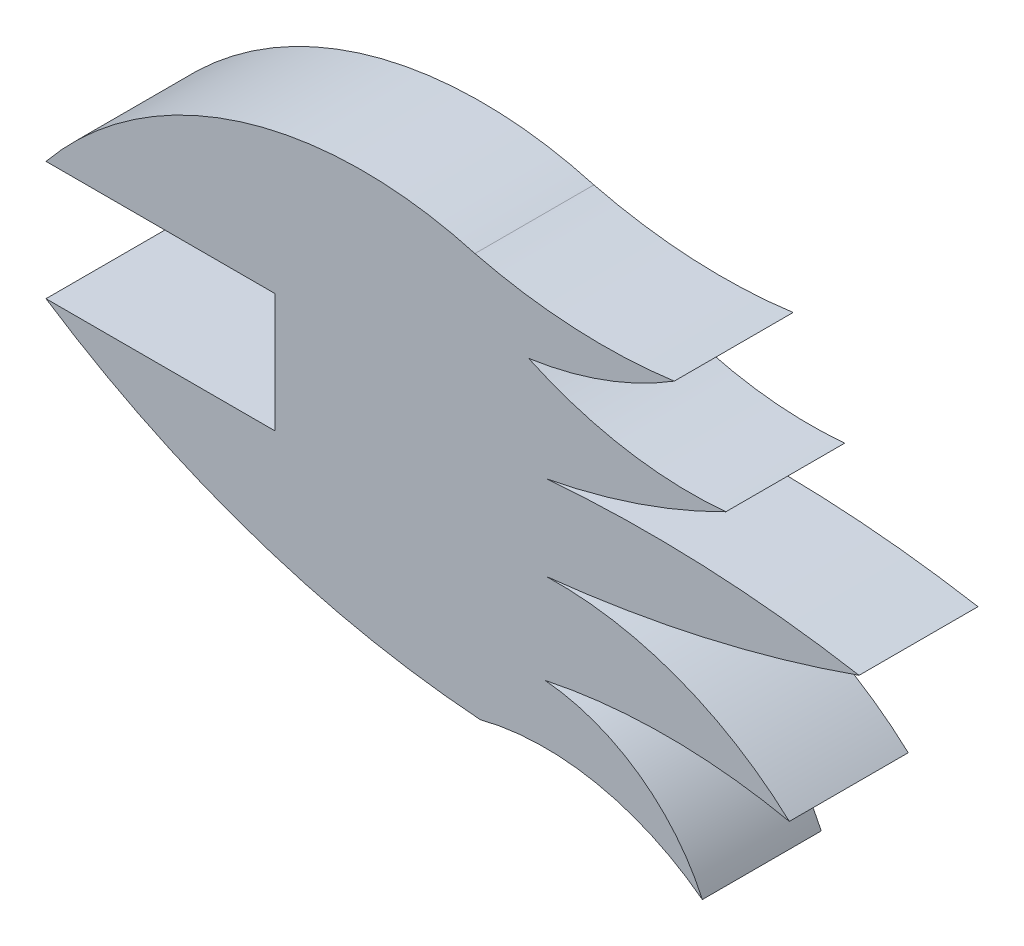
ISO-10303-21;
HEADER;
FILE_DESCRIPTION(('STEP AP214'),'2;1');
FILE_NAME('part.step','',(''),(''),'','','');
FILE_SCHEMA(('AUTOMOTIVE_DESIGN { 1 0 10303 214 1 1 1 1 }'));
ENDSEC;
DATA;
#1=APPLICATION_CONTEXT('core data for automotive mechanical design processes');
#2=APPLICATION_PROTOCOL_DEFINITION('international standard','automotive_design',2000,#1);
#3=PRODUCT_CONTEXT('',#1,'mechanical');
#4=PRODUCT('Part','Part','',(#3));
#5=PRODUCT_RELATED_PRODUCT_CATEGORY('part','',(#4));
#6=PRODUCT_DEFINITION_FORMATION('','',#4);
#7=PRODUCT_DEFINITION_CONTEXT('part definition',#1,'design');
#8=PRODUCT_DEFINITION('design','',#6,#7);
#9=PRODUCT_DEFINITION_SHAPE('','',#8);
#10=(LENGTH_UNIT() NAMED_UNIT(*) SI_UNIT(.MILLI.,.METRE.));
#11=(NAMED_UNIT(*) PLANE_ANGLE_UNIT() SI_UNIT($,.RADIAN.));
#12=(NAMED_UNIT(*) SI_UNIT($,.STERADIAN.) SOLID_ANGLE_UNIT());
#13=UNCERTAINTY_MEASURE_WITH_UNIT(LENGTH_MEASURE(1.E-05),#10,'distance_accuracy_value','');
#14=(GEOMETRIC_REPRESENTATION_CONTEXT(3) GLOBAL_UNCERTAINTY_ASSIGNED_CONTEXT((#13)) GLOBAL_UNIT_ASSIGNED_CONTEXT((#10,
#11,#12)) REPRESENTATION_CONTEXT('',''));
#15=CARTESIAN_POINT('',(0.,0.,0.));
#16=DIRECTION('',(0.,0.,1.));
#17=DIRECTION('',(1.,0.,0.));
#18=AXIS2_PLACEMENT_3D('',#15,#16,#17);
#19=CARTESIAN_POINT('',(20.7675608473323,1.524,1.524));
#20=DIRECTION('',(0.,1.,0.));
#21=DIRECTION('',(0.,0.,1.));
#22=AXIS2_PLACEMENT_3D('',#19,#20,#21);
#23=PLANE('',#22);
#24=DIRECTION('',(1.,0.,0.));
#25=VECTOR('',#24,1.);
#26=CARTESIAN_POINT('',(20.7675608473323,1.524,0.));
#27=LINE('',#26,#25);
#28=CARTESIAN_POINT('',(20.7675608473323,1.524,0.));
#29=VERTEX_POINT('',#28);
#30=CARTESIAN_POINT('',(23.6997454879584,1.524,0.));
#31=VERTEX_POINT('',#30);
#32=EDGE_CURVE('E171',#29,#31,#27,.T.);
#33=ORIENTED_EDGE('',*,*,#32,.T.);
#34=DIRECTION('',(0.,0.,-1.));
#35=VECTOR('',#34,1.);
#36=CARTESIAN_POINT('',(23.6997454879584,1.524,1.524));
#37=LINE('',#36,#35);
#38=CARTESIAN_POINT('',(23.6997454879584,1.524,1.524));
#39=VERTEX_POINT('',#38);
#40=EDGE_CURVE('E11',#39,#31,#37,.T.);
#41=ORIENTED_EDGE('',*,*,#40,.F.);
#42=DIRECTION('',(1.,0.,0.));
#43=VECTOR('',#42,1.);
#44=CARTESIAN_POINT('',(20.7675608473323,1.524,1.524));
#45=LINE('',#44,#43);
#46=CARTESIAN_POINT('',(20.7675608473323,1.524,1.524));
#47=VERTEX_POINT('',#46);
#48=EDGE_CURVE('E199',#47,#39,#45,.T.);
#49=ORIENTED_EDGE('',*,*,#48,.F.);
#50=DIRECTION('',(0.,0.,-1.));
#51=VECTOR('',#50,1.);
#52=CARTESIAN_POINT('',(20.7675608473323,1.524,1.524));
#53=LINE('',#52,#51);
#54=EDGE_CURVE('E167',#47,#29,#53,.T.);
#55=ORIENTED_EDGE('',*,*,#54,.T.);
#56=EDGE_LOOP('',(#33,#41,#49,#55));
#57=FACE_BOUND('',#56,.T.);
#58=ADVANCED_FACE('F33',(#57),#23,.F.);
#59=CARTESIAN_POINT('',(23.6997454879584,1.524,1.524));
#60=DIRECTION('',(1.,0.,0.));
#61=DIRECTION('',(0.,0.,-1.));
#62=AXIS2_PLACEMENT_3D('',#59,#60,#61);
#63=PLANE('',#62);
#64=DIRECTION('',(0.,-1.,0.));
#65=VECTOR('',#64,1.);
#66=CARTESIAN_POINT('',(23.6997454879584,1.524,0.));
#67=LINE('',#66,#65);
#68=CARTESIAN_POINT('',(23.6997454879584,0.,0.));
#69=VERTEX_POINT('',#68);
#70=EDGE_CURVE('E174',#31,#69,#67,.T.);
#71=ORIENTED_EDGE('',*,*,#70,.T.);
#72=DIRECTION('',(0.,0.,-1.));
#73=VECTOR('',#72,1.);
#74=CARTESIAN_POINT('',(23.6997454879584,0.,1.524));
#75=LINE('',#74,#73);
#76=CARTESIAN_POINT('',(23.6997454879584,0.,1.524));
#77=VERTEX_POINT('',#76);
#78=EDGE_CURVE('E41',#77,#69,#75,.T.);
#79=ORIENTED_EDGE('',*,*,#78,.F.);
#80=DIRECTION('',(0.,-1.,0.));
#81=VECTOR('',#80,1.);
#82=CARTESIAN_POINT('',(23.6997454879584,1.524,1.524));
#83=LINE('',#82,#81);
#84=EDGE_CURVE('E113',#39,#77,#83,.T.);
#85=ORIENTED_EDGE('',*,*,#84,.F.);
#86=ORIENTED_EDGE('',*,*,#40,.T.);
#87=EDGE_LOOP('',(#71,#79,#85,#86));
#88=FACE_BOUND('',#87,.T.);
#89=ADVANCED_FACE('F292',(#88),#63,.F.);
#90=CARTESIAN_POINT('',(23.6997454879584,0.,1.524));
#91=DIRECTION('',(0.,-1.,0.));
#92=DIRECTION('',(1.,0.,0.));
#93=AXIS2_PLACEMENT_3D('',#90,#91,#92);
#94=PLANE('',#93);
#95=DIRECTION('',(-1.,0.,0.));
#96=VECTOR('',#95,1.);
#97=CARTESIAN_POINT('',(23.6997454879584,0.,0.));
#98=LINE('',#97,#96);
#99=CARTESIAN_POINT('',(20.7675608473323,0.,0.));
#100=VERTEX_POINT('',#99);
#101=EDGE_CURVE('E176',#69,#100,#98,.T.);
#102=ORIENTED_EDGE('',*,*,#101,.T.);
#103=DIRECTION('',(0.,0.,-1.));
#104=VECTOR('',#103,1.);
#105=CARTESIAN_POINT('',(20.7675608473323,0.,1.524));
#106=LINE('',#105,#104);
#107=CARTESIAN_POINT('',(20.7675608473323,0.,1.524));
#108=VERTEX_POINT('',#107);
#109=EDGE_CURVE('E227',#108,#100,#106,.T.);
#110=ORIENTED_EDGE('',*,*,#109,.F.);
#111=DIRECTION('',(-1.,0.,0.));
#112=VECTOR('',#111,1.);
#113=CARTESIAN_POINT('',(23.6997454879584,0.,1.524));
#114=LINE('',#113,#112);
#115=EDGE_CURVE('E235',#77,#108,#114,.T.);
#116=ORIENTED_EDGE('',*,*,#115,.F.);
#117=ORIENTED_EDGE('',*,*,#78,.T.);
#118=EDGE_LOOP('',(#102,#110,#116,#117));
#119=FACE_BOUND('',#118,.T.);
#120=ADVANCED_FACE('F233',(#119),#94,.F.);
#121=CARTESIAN_POINT('',(27.1776081469586,9.73600604381331,1.524));
#122=DIRECTION('',(0.,0.,-1.));
#123=DIRECTION('',(-1.,0.,0.));
#124=AXIS2_PLACEMENT_3D('',#121,#122,#123);
#125=CYLINDRICAL_SURFACE('',#124,11.6566942169989);
#126=CARTESIAN_POINT('',(27.1776081469586,9.73600604381331,0.));
#127=DIRECTION('',(0.,0.,1.));
#128=DIRECTION('',(1.,0.,0.));
#129=AXIS2_PLACEMENT_3D('',#126,#127,#128);
#130=CIRCLE('',#129,11.6566942169989);
#131=CARTESIAN_POINT('',(26.3328732341961,-1.89003984444014,0.));
#132=VERTEX_POINT('',#131);
#133=EDGE_CURVE('E178',#100,#132,#130,.T.);
#134=ORIENTED_EDGE('',*,*,#133,.T.);
#135=DIRECTION('',(0.,0.,-1.));
#136=VECTOR('',#135,1.);
#137=CARTESIAN_POINT('',(26.3328732341961,-1.89003984444014,1.524));
#138=LINE('',#137,#136);
#139=CARTESIAN_POINT('',(26.3328732341961,-1.89003984444014,1.524));
#140=VERTEX_POINT('',#139);
#141=EDGE_CURVE('E224',#140,#132,#138,.T.);
#142=ORIENTED_EDGE('',*,*,#141,.F.);
#143=CARTESIAN_POINT('',(27.1776081469586,9.73600604381331,1.524));
#144=DIRECTION('',(0.,0.,1.));
#145=DIRECTION('',(1.,0.,0.));
#146=AXIS2_PLACEMENT_3D('',#143,#144,#145);
#147=CIRCLE('',#146,11.6566942169989);
#148=EDGE_CURVE('E253',#108,#140,#147,.T.);
#149=ORIENTED_EDGE('',*,*,#148,.F.);
#150=ORIENTED_EDGE('',*,*,#109,.T.);
#151=EDGE_LOOP('',(#134,#142,#149,#150));
#152=FACE_BOUND('',#151,.T.);
#153=ADVANCED_FACE('F244',(#152),#125,.T.);
#154=CARTESIAN_POINT('',(27.1632248305572,-5.12097381542239,1.524));
#155=DIRECTION('',(0.,0.,-1.));
#156=DIRECTION('',(-1.,0.,0.));
#157=AXIS2_PLACEMENT_3D('',#154,#155,#156);
#158=CYLINDRICAL_SURFACE('',#157,3.33592837129734);
#159=CARTESIAN_POINT('',(27.1632248305572,-5.12097381542239,0.));
#160=DIRECTION('',(0.,0.,-1.));
#161=DIRECTION('',(-1.,0.,0.));
#162=AXIS2_PLACEMENT_3D('',#159,#160,#161);
#163=CIRCLE('',#162,3.33592837129734);
#164=CARTESIAN_POINT('',(29.1798257206892,-2.46358055353113,0.));
#165=VERTEX_POINT('',#164);
#166=EDGE_CURVE('E180',#132,#165,#163,.T.);
#167=ORIENTED_EDGE('',*,*,#166,.T.);
#168=DIRECTION('',(0.,0.,-1.));
#169=VECTOR('',#168,1.);
#170=CARTESIAN_POINT('',(29.1798257206892,-2.46358055353113,1.524));
#171=LINE('',#170,#169);
#172=CARTESIAN_POINT('',(29.1798257206892,-2.46358055353113,1.524));
#173=VERTEX_POINT('',#172);
#174=EDGE_CURVE('E221',#173,#165,#171,.T.);
#175=ORIENTED_EDGE('',*,*,#174,.F.);
#176=CARTESIAN_POINT('',(27.1632248305572,-5.12097381542239,1.524));
#177=DIRECTION('',(0.,0.,-1.));
#178=DIRECTION('',(-1.,0.,0.));
#179=AXIS2_PLACEMENT_3D('',#176,#177,#178);
#180=CIRCLE('',#179,3.33592837129734);
#181=EDGE_CURVE('E250',#140,#173,#180,.T.);
#182=ORIENTED_EDGE('',*,*,#181,.F.);
#183=ORIENTED_EDGE('',*,*,#141,.T.);
#184=EDGE_LOOP('',(#167,#175,#182,#183));
#185=FACE_BOUND('',#184,.T.);
#186=ADVANCED_FACE('F248',(#185),#158,.F.);
#187=CARTESIAN_POINT('',(26.9522984770902,-3.47622261682482,1.524));
#188=DIRECTION('',(0.,0.,-1.));
#189=DIRECTION('',(-1.,0.,0.));
#190=AXIS2_PLACEMENT_3D('',#187,#188,#189);
#191=CYLINDRICAL_SURFACE('',#190,2.4469004003693);
#192=CARTESIAN_POINT('',(26.9522984770902,-3.47622261682482,0.));
#193=DIRECTION('',(0.,0.,1.));
#194=DIRECTION('',(1.,0.,0.));
#195=AXIS2_PLACEMENT_3D('',#192,#193,#194);
#196=CIRCLE('',#195,2.4469004003693);
#197=CARTESIAN_POINT('',(27.1632248305572,-1.03843024610484,0.));
#198=VERTEX_POINT('',#197);
#199=EDGE_CURVE('E182',#165,#198,#196,.T.);
#200=ORIENTED_EDGE('',*,*,#199,.T.);
#201=DIRECTION('',(0.,0.,-1.));
#202=VECTOR('',#201,1.);
#203=CARTESIAN_POINT('',(27.1632248305572,-1.03843024610484,1.524));
#204=LINE('',#203,#202);
#205=CARTESIAN_POINT('',(27.1632248305572,-1.03843024610484,1.524));
#206=VERTEX_POINT('',#205);
#207=EDGE_CURVE('E218',#206,#198,#204,.T.);
#208=ORIENTED_EDGE('',*,*,#207,.F.);
#209=CARTESIAN_POINT('',(26.9522984770902,-3.47622261682482,1.524));
#210=DIRECTION('',(0.,0.,1.));
#211=DIRECTION('',(1.,0.,0.));
#212=AXIS2_PLACEMENT_3D('',#209,#210,#211);
#213=CIRCLE('',#212,2.4469004003693);
#214=EDGE_CURVE('E252',#173,#206,#213,.T.);
#215=ORIENTED_EDGE('',*,*,#214,.F.);
#216=ORIENTED_EDGE('',*,*,#174,.T.);
#217=EDGE_LOOP('',(#200,#208,#215,#216));
#218=FACE_BOUND('',#217,.T.);
#219=ADVANCED_FACE('F305',(#218),#191,.T.);
#220=CARTESIAN_POINT('',(28.7289240565219,-8.46065112007012,1.524));
#221=DIRECTION('',(0.,0.,-1.));
#222=DIRECTION('',(-1.,0.,0.));
#223=AXIS2_PLACEMENT_3D('',#220,#221,#222);
#224=CYLINDRICAL_SURFACE('',#223,7.58556370799906);
#225=CARTESIAN_POINT('',(28.7289240565219,-8.46065112007012,0.));
#226=DIRECTION('',(0.,0.,-1.));
#227=DIRECTION('',(-1.,0.,0.));
#228=AXIS2_PLACEMENT_3D('',#225,#226,#227);
#229=CIRCLE('',#228,7.58556370799906);
#230=CARTESIAN_POINT('',(30.2946232824866,-1.03843024610484,0.));
#231=VERTEX_POINT('',#230);
#232=EDGE_CURVE('E184',#198,#231,#229,.T.);
#233=ORIENTED_EDGE('',*,*,#232,.T.);
#234=DIRECTION('',(0.,0.,-1.));
#235=VECTOR('',#234,1.);
#236=CARTESIAN_POINT('',(30.2946232824866,-1.03843024610484,1.524));
#237=LINE('',#236,#235);
#238=CARTESIAN_POINT('',(30.2946232824866,-1.03843024610484,1.524));
#239=VERTEX_POINT('',#238);
#240=EDGE_CURVE('E215',#239,#231,#237,.T.);
#241=ORIENTED_EDGE('',*,*,#240,.F.);
#242=CARTESIAN_POINT('',(28.7289240565219,-8.46065112007012,1.524));
#243=DIRECTION('',(0.,0.,-1.));
#244=DIRECTION('',(-1.,0.,0.));
#245=AXIS2_PLACEMENT_3D('',#242,#243,#244);
#246=CIRCLE('',#245,7.58556370799906);
#247=EDGE_CURVE('E255',#206,#239,#246,.T.);
#248=ORIENTED_EDGE('',*,*,#247,.F.);
#249=ORIENTED_EDGE('',*,*,#207,.T.);
#250=EDGE_LOOP('',(#233,#241,#248,#249));
#251=FACE_BOUND('',#250,.T.);
#252=ADVANCED_FACE('F308',(#251),#224,.F.);
#253=CARTESIAN_POINT('',(27.3013956665733,-4.30781651667103,1.524));
#254=DIRECTION('',(0.,0.,-1.));
#255=DIRECTION('',(-1.,0.,0.));
#256=AXIS2_PLACEMENT_3D('',#253,#254,#255);
#257=CYLINDRICAL_SURFACE('',#256,4.43264008767153);
#258=CARTESIAN_POINT('',(27.3013956665733,-4.30781651667103,0.));
#259=DIRECTION('',(0.,0.,1.));
#260=DIRECTION('',(1.,0.,0.));
#261=AXIS2_PLACEMENT_3D('',#258,#259,#260);
#262=CIRCLE('',#261,4.43264008767153);
#263=CARTESIAN_POINT('',(27.1776081469586,0.123094766216525,0.));
#264=VERTEX_POINT('',#263);
#265=EDGE_CURVE('E186',#231,#264,#262,.T.);
#266=ORIENTED_EDGE('',*,*,#265,.T.);
#267=DIRECTION('',(0.,0.,-1.));
#268=VECTOR('',#267,1.);
#269=CARTESIAN_POINT('',(27.1776081469586,0.123094766216525,1.524));
#270=LINE('',#269,#268);
#271=CARTESIAN_POINT('',(27.1776081469586,0.123094766216525,1.524));
#272=VERTEX_POINT('',#271);
#273=EDGE_CURVE('E212',#272,#264,#270,.T.);
#274=ORIENTED_EDGE('',*,*,#273,.F.);
#275=CARTESIAN_POINT('',(27.3013956665733,-4.30781651667103,1.524));
#276=DIRECTION('',(0.,0.,1.));
#277=DIRECTION('',(1.,0.,0.));
#278=AXIS2_PLACEMENT_3D('',#275,#276,#277);
#279=CIRCLE('',#278,4.43264008767153);
#280=EDGE_CURVE('E261',#239,#272,#279,.T.);
#281=ORIENTED_EDGE('',*,*,#280,.F.);
#282=ORIENTED_EDGE('',*,*,#240,.T.);
#283=EDGE_LOOP('',(#266,#274,#281,#282));
#284=FACE_BOUND('',#283,.T.);
#285=ADVANCED_FACE('F312',(#284),#257,.T.);
#286=CARTESIAN_POINT('',(25.3174972946069,17.6726329506444,1.524));
#287=DIRECTION('',(0.,0.,-1.));
#288=DIRECTION('',(-1.,0.,0.));
#289=AXIS2_PLACEMENT_3D('',#286,#287,#288);
#290=CYLINDRICAL_SURFACE('',#289,17.647841309059);
#291=CARTESIAN_POINT('',(25.3174972946069,17.6726329506444,0.));
#292=DIRECTION('',(0.,0.,1.));
#293=DIRECTION('',(1.,0.,0.));
#294=AXIS2_PLACEMENT_3D('',#291,#292,#293);
#295=CIRCLE('',#294,17.647841309059);
#296=CARTESIAN_POINT('',(31.1887077932624,1.0300613299421,0.));
#297=VERTEX_POINT('',#296);
#298=EDGE_CURVE('E188',#264,#297,#295,.T.);
#299=ORIENTED_EDGE('',*,*,#298,.T.);
#300=DIRECTION('',(0.,0.,-1.));
#301=VECTOR('',#300,1.);
#302=CARTESIAN_POINT('',(31.1887077932624,1.0300613299421,1.524));
#303=LINE('',#302,#301);
#304=CARTESIAN_POINT('',(31.1887077932624,1.0300613299421,1.524));
#305=VERTEX_POINT('',#304);
#306=EDGE_CURVE('E209',#305,#297,#303,.T.);
#307=ORIENTED_EDGE('',*,*,#306,.F.);
#308=CARTESIAN_POINT('',(25.3174972946069,17.6726329506444,1.524));
#309=DIRECTION('',(0.,0.,1.));
#310=DIRECTION('',(1.,0.,0.));
#311=AXIS2_PLACEMENT_3D('',#308,#309,#310);
#312=CIRCLE('',#311,17.647841309059);
#313=EDGE_CURVE('E263',#272,#305,#312,.T.);
#314=ORIENTED_EDGE('',*,*,#313,.F.);
#315=ORIENTED_EDGE('',*,*,#273,.T.);
#316=EDGE_LOOP('',(#299,#307,#314,#315));
#317=FACE_BOUND('',#316,.T.);
#318=ADVANCED_FACE('F316',(#317),#290,.T.);
#319=CARTESIAN_POINT('',(28.493429563591,-14.4407143083022,1.524));
#320=DIRECTION('',(0.,0.,-1.));
#321=DIRECTION('',(-1.,0.,0.));
#322=AXIS2_PLACEMENT_3D('',#319,#320,#321);
#323=CYLINDRICAL_SURFACE('',#322,15.7038028383011);
#324=CARTESIAN_POINT('',(28.493429563591,-14.4407143083022,0.));
#325=DIRECTION('',(0.,0.,1.));
#326=DIRECTION('',(1.,0.,0.));
#327=AXIS2_PLACEMENT_3D('',#324,#325,#326);
#328=CIRCLE('',#327,15.7038028383011);
#329=CARTESIAN_POINT('',(27.1776081469586,1.20786510274229,0.));
#330=VERTEX_POINT('',#329);
#331=EDGE_CURVE('E190',#297,#330,#328,.T.);
#332=ORIENTED_EDGE('',*,*,#331,.T.);
#333=DIRECTION('',(0.,0.,-1.));
#334=VECTOR('',#333,1.);
#335=CARTESIAN_POINT('',(27.1776081469586,1.20786510274229,1.524));
#336=LINE('',#335,#334);
#337=CARTESIAN_POINT('',(27.1776081469586,1.20786510274229,1.524));
#338=VERTEX_POINT('',#337);
#339=EDGE_CURVE('E206',#338,#330,#336,.T.);
#340=ORIENTED_EDGE('',*,*,#339,.F.);
#341=CARTESIAN_POINT('',(28.493429563591,-14.4407143083022,1.524));
#342=DIRECTION('',(0.,0.,1.));
#343=DIRECTION('',(1.,0.,0.));
#344=AXIS2_PLACEMENT_3D('',#341,#342,#343);
#345=CIRCLE('',#344,15.7038028383011);
#346=EDGE_CURVE('E265',#305,#338,#345,.T.);
#347=ORIENTED_EDGE('',*,*,#346,.F.);
#348=ORIENTED_EDGE('',*,*,#306,.T.);
#349=EDGE_LOOP('',(#332,#340,#347,#348));
#350=FACE_BOUND('',#349,.T.);
#351=ADVANCED_FACE('F320',(#350),#323,.T.);
#352=CARTESIAN_POINT('',(25.581469829603,9.67666189750758,1.524));
#353=DIRECTION('',(0.,0.,-1.));
#354=DIRECTION('',(-1.,0.,0.));
#355=AXIS2_PLACEMENT_3D('',#352,#353,#354);
#356=CYLINDRICAL_SURFACE('',#355,8.61789862316548);
#357=CARTESIAN_POINT('',(25.581469829603,9.67666189750758,0.));
#358=DIRECTION('',(0.,0.,1.));
#359=DIRECTION('',(1.,0.,0.));
#360=AXIS2_PLACEMENT_3D('',#357,#358,#359);
#361=CIRCLE('',#360,8.61789862316548);
#362=CARTESIAN_POINT('',(29.4810472072837,1.9915156429046,0.));
#363=VERTEX_POINT('',#362);
#364=EDGE_CURVE('E192',#330,#363,#361,.T.);
#365=ORIENTED_EDGE('',*,*,#364,.T.);
#366=DIRECTION('',(0.,0.,-1.));
#367=VECTOR('',#366,1.);
#368=CARTESIAN_POINT('',(29.4810472072837,1.9915156429046,1.524));
#369=LINE('',#368,#367);
#370=CARTESIAN_POINT('',(29.4810472072837,1.9915156429046,1.524));
#371=VERTEX_POINT('',#370);
#372=EDGE_CURVE('E203',#371,#363,#369,.T.);
#373=ORIENTED_EDGE('',*,*,#372,.F.);
#374=CARTESIAN_POINT('',(25.581469829603,9.67666189750758,1.524));
#375=DIRECTION('',(0.,0.,1.));
#376=DIRECTION('',(1.,0.,0.));
#377=AXIS2_PLACEMENT_3D('',#374,#375,#376);
#378=CIRCLE('',#377,8.61789862316548);
#379=EDGE_CURVE('E267',#338,#371,#378,.T.);
#380=ORIENTED_EDGE('',*,*,#379,.F.);
#381=ORIENTED_EDGE('',*,*,#339,.T.);
#382=EDGE_LOOP('',(#365,#373,#380,#381));
#383=FACE_BOUND('',#382,.T.);
#384=ADVANCED_FACE('F273',(#383),#356,.T.);
#385=CARTESIAN_POINT('',(29.0332580864265,6.91333764515148,1.524));
#386=DIRECTION('',(0.,0.,-1.));
#387=DIRECTION('',(-1.,0.,0.));
#388=AXIS2_PLACEMENT_3D('',#385,#386,#387);
#389=CYLINDRICAL_SURFACE('',#388,4.94215002995251);
#390=CARTESIAN_POINT('',(29.0332580864265,6.91333764515148,0.));
#391=DIRECTION('',(0.,0.,-1.));
#392=DIRECTION('',(-1.,0.,0.));
#393=AXIS2_PLACEMENT_3D('',#390,#391,#392);
#394=CIRCLE('',#393,4.94215002995251);
#395=CARTESIAN_POINT('',(26.9522984770902,2.4306538482648,0.));
#396=VERTEX_POINT('',#395);
#397=EDGE_CURVE('E194',#363,#396,#394,.T.);
#398=ORIENTED_EDGE('',*,*,#397,.T.);
#399=DIRECTION('',(0.,0.,-1.));
#400=VECTOR('',#399,1.);
#401=CARTESIAN_POINT('',(26.9522984770902,2.4306538482648,1.524));
#402=LINE('',#401,#400);
#403=CARTESIAN_POINT('',(26.9522984770902,2.4306538482648,1.524));
#404=VERTEX_POINT('',#403);
#405=EDGE_CURVE('E162',#404,#396,#402,.T.);
#406=ORIENTED_EDGE('',*,*,#405,.F.);
#407=CARTESIAN_POINT('',(29.0332580864265,6.91333764515148,1.524));
#408=DIRECTION('',(0.,0.,-1.));
#409=DIRECTION('',(-1.,0.,0.));
#410=AXIS2_PLACEMENT_3D('',#407,#408,#409);
#411=CIRCLE('',#410,4.94215002995251);
#412=EDGE_CURVE('E153',#371,#404,#411,.T.);
#413=ORIENTED_EDGE('',*,*,#412,.F.);
#414=ORIENTED_EDGE('',*,*,#372,.T.);
#415=EDGE_LOOP('',(#398,#406,#413,#414));
#416=FACE_BOUND('',#415,.T.);
#417=ADVANCED_FACE('F277',(#416),#389,.F.);
#418=CARTESIAN_POINT('',(26.2656196775541,7.21871563016818,1.524));
#419=DIRECTION('',(0.,0.,-1.));
#420=DIRECTION('',(-1.,0.,0.));
#421=AXIS2_PLACEMENT_3D('',#418,#419,#420);
#422=CYLINDRICAL_SURFACE('',#421,4.83705110589666);
#423=CARTESIAN_POINT('',(26.2656196775541,7.21871563016818,0.));
#424=DIRECTION('',(0.,0.,1.));
#425=DIRECTION('',(1.,0.,0.));
#426=AXIS2_PLACEMENT_3D('',#423,#424,#425);
#427=CIRCLE('',#426,4.83705110589666);
#428=CARTESIAN_POINT('',(28.8194545471963,3.11079756140682,0.));
#429=VERTEX_POINT('',#428);
#430=EDGE_CURVE('E161',#396,#429,#427,.T.);
#431=ORIENTED_EDGE('',*,*,#430,.T.);
#432=DIRECTION('',(0.,0.,-1.));
#433=VECTOR('',#432,1.);
#434=CARTESIAN_POINT('',(28.8194545471963,3.11079756140682,1.524));
#435=LINE('',#434,#433);
#436=CARTESIAN_POINT('',(28.8194545471963,3.11079756140682,1.524));
#437=VERTEX_POINT('',#436);
#438=EDGE_CURVE('E158',#437,#429,#435,.T.);
#439=ORIENTED_EDGE('',*,*,#438,.F.);
#440=CARTESIAN_POINT('',(26.2656196775541,7.21871563016818,1.524));
#441=DIRECTION('',(0.,0.,1.));
#442=DIRECTION('',(1.,0.,0.));
#443=AXIS2_PLACEMENT_3D('',#440,#441,#442);
#444=CIRCLE('',#443,4.83705110589666);
#445=EDGE_CURVE('E147',#404,#437,#444,.T.);
#446=ORIENTED_EDGE('',*,*,#445,.F.);
#447=ORIENTED_EDGE('',*,*,#405,.T.);
#448=EDGE_LOOP('',(#431,#439,#446,#447));
#449=FACE_BOUND('',#448,.T.);
#450=ADVANCED_FACE('F159',(#449),#422,.T.);
#451=CARTESIAN_POINT('',(27.9058912790934,9.85468299509207,1.524));
#452=DIRECTION('',(0.,0.,-1.));
#453=DIRECTION('',(-1.,0.,0.));
#454=AXIS2_PLACEMENT_3D('',#451,#452,#453);
#455=CYLINDRICAL_SURFACE('',#454,6.8054822450359);
#456=CARTESIAN_POINT('',(27.9058912790934,9.85468299509207,0.));
#457=DIRECTION('',(0.,0.,-1.));
#458=DIRECTION('',(-1.,0.,0.));
#459=AXIS2_PLACEMENT_3D('',#456,#457,#458);
#460=CIRCLE('',#459,6.8054822450359);
#461=CARTESIAN_POINT('',(26.2656196775541,3.24982889672753,0.));
#462=VERTEX_POINT('',#461);
#463=EDGE_CURVE('E99',#429,#462,#460,.T.);
#464=ORIENTED_EDGE('',*,*,#463,.T.);
#465=DIRECTION('',(0.,0.,-1.));
#466=VECTOR('',#465,1.);
#467=CARTESIAN_POINT('',(26.2656196775541,3.24982889672753,1.524));
#468=LINE('',#467,#466);
#469=CARTESIAN_POINT('',(26.2656196775541,3.24982889672753,1.524));
#470=VERTEX_POINT('',#469);
#471=EDGE_CURVE('E163',#470,#462,#468,.T.);
#472=ORIENTED_EDGE('',*,*,#471,.F.);
#473=CARTESIAN_POINT('',(27.9058912790934,9.85468299509207,1.524));
#474=DIRECTION('',(0.,0.,-1.));
#475=DIRECTION('',(-1.,0.,0.));
#476=AXIS2_PLACEMENT_3D('',#473,#474,#475);
#477=CIRCLE('',#476,6.8054822450359);
#478=EDGE_CURVE('E151',#437,#470,#477,.T.);
#479=ORIENTED_EDGE('',*,*,#478,.F.);
#480=ORIENTED_EDGE('',*,*,#438,.T.);
#481=EDGE_LOOP('',(#464,#472,#479,#480));
#482=FACE_BOUND('',#481,.T.);
#483=ADVANCED_FACE('F165',(#482),#455,.F.);
#484=CARTESIAN_POINT('',(24.8293078780809,-1.79507525636871,1.524));
#485=DIRECTION('',(0.,0.,-1.));
#486=DIRECTION('',(-1.,0.,0.));
#487=AXIS2_PLACEMENT_3D('',#484,#485,#486);
#488=CYLINDRICAL_SURFACE('',#487,5.24538363699298);
#489=CARTESIAN_POINT('',(24.8293078780809,-1.79507525636871,0.));
#490=DIRECTION('',(0.,0.,1.));
#491=DIRECTION('',(1.,0.,0.));
#492=AXIS2_PLACEMENT_3D('',#489,#490,#491);
#493=CIRCLE('',#492,5.24538363699298);
#494=EDGE_CURVE('E105',#462,#29,#493,.T.);
#495=ORIENTED_EDGE('',*,*,#494,.T.);
#496=ORIENTED_EDGE('',*,*,#54,.F.);
#497=CARTESIAN_POINT('',(24.8293078780809,-1.79507525636871,1.524));
#498=DIRECTION('',(0.,0.,1.));
#499=DIRECTION('',(1.,0.,0.));
#500=AXIS2_PLACEMENT_3D('',#497,#498,#499);
#501=CIRCLE('',#500,5.24538363699298);
#502=EDGE_CURVE('E49',#470,#47,#501,.T.);
#503=ORIENTED_EDGE('',*,*,#502,.F.);
#504=ORIENTED_EDGE('',*,*,#471,.T.);
#505=EDGE_LOOP('',(#495,#496,#503,#504));
#506=FACE_BOUND('',#505,.T.);
#507=ADVANCED_FACE('F281',(#506),#488,.T.);
#508=CARTESIAN_POINT('',(27.1776081469586,9.73600604381331,1.524));
#509=DIRECTION('',(0.,0.,1.));
#510=DIRECTION('',(1.,0.,0.));
#511=AXIS2_PLACEMENT_3D('',#508,#509,#510);
#512=PLANE('',#511);
#513=ORIENTED_EDGE('',*,*,#48,.T.);
#514=ORIENTED_EDGE('',*,*,#84,.T.);
#515=ORIENTED_EDGE('',*,*,#115,.T.);
#516=ORIENTED_EDGE('',*,*,#148,.T.);
#517=ORIENTED_EDGE('',*,*,#181,.T.);
#518=ORIENTED_EDGE('',*,*,#214,.T.);
#519=ORIENTED_EDGE('',*,*,#247,.T.);
#520=ORIENTED_EDGE('',*,*,#280,.T.);
#521=ORIENTED_EDGE('',*,*,#313,.T.);
#522=ORIENTED_EDGE('',*,*,#346,.T.);
#523=ORIENTED_EDGE('',*,*,#379,.T.);
#524=ORIENTED_EDGE('',*,*,#412,.T.);
#525=ORIENTED_EDGE('',*,*,#445,.T.);
#526=ORIENTED_EDGE('',*,*,#478,.T.);
#527=ORIENTED_EDGE('',*,*,#502,.T.);
#528=EDGE_LOOP('',(#513,#514,#515,#516,#517,#518,#519,#520,#521,#522,#523,#524,#525,#526,#527));
#529=FACE_BOUND('',#528,.T.);
#530=ADVANCED_FACE('F149',(#529),#512,.T.);
#531=CARTESIAN_POINT('',(27.1776081469586,9.73600604381331,0.));
#532=DIRECTION('',(0.,0.,1.));
#533=DIRECTION('',(1.,0.,0.));
#534=AXIS2_PLACEMENT_3D('',#531,#532,#533);
#535=PLANE('',#534);
#536=ORIENTED_EDGE('',*,*,#32,.F.);
#537=ORIENTED_EDGE('',*,*,#494,.F.);
#538=ORIENTED_EDGE('',*,*,#463,.F.);
#539=ORIENTED_EDGE('',*,*,#430,.F.);
#540=ORIENTED_EDGE('',*,*,#397,.F.);
#541=ORIENTED_EDGE('',*,*,#364,.F.);
#542=ORIENTED_EDGE('',*,*,#331,.F.);
#543=ORIENTED_EDGE('',*,*,#298,.F.);
#544=ORIENTED_EDGE('',*,*,#265,.F.);
#545=ORIENTED_EDGE('',*,*,#232,.F.);
#546=ORIENTED_EDGE('',*,*,#199,.F.);
#547=ORIENTED_EDGE('',*,*,#166,.F.);
#548=ORIENTED_EDGE('',*,*,#133,.F.);
#549=ORIENTED_EDGE('',*,*,#101,.F.);
#550=ORIENTED_EDGE('',*,*,#70,.F.);
#551=EDGE_LOOP('',(#536,#537,#538,#539,#540,#541,#542,#543,#544,#545,#546,#547,#548,#549,#550));
#552=FACE_BOUND('',#551,.T.);
#553=ADVANCED_FACE('F239',(#552),#535,.F.);
#554=CLOSED_SHELL('',(#58,#89,#120,#153,#186,#219,#252,#285,#318,#351,#384,#417,#450,#483,#507,
#530,#553));
#555=MANIFOLD_SOLID_BREP('B2',#554);
#556=ADVANCED_BREP_SHAPE_REPRESENTATION('',(#18,#555),#14);
#557=SHAPE_DEFINITION_REPRESENTATION(#9,#556);
ENDSEC;
END-ISO-10303-21;
